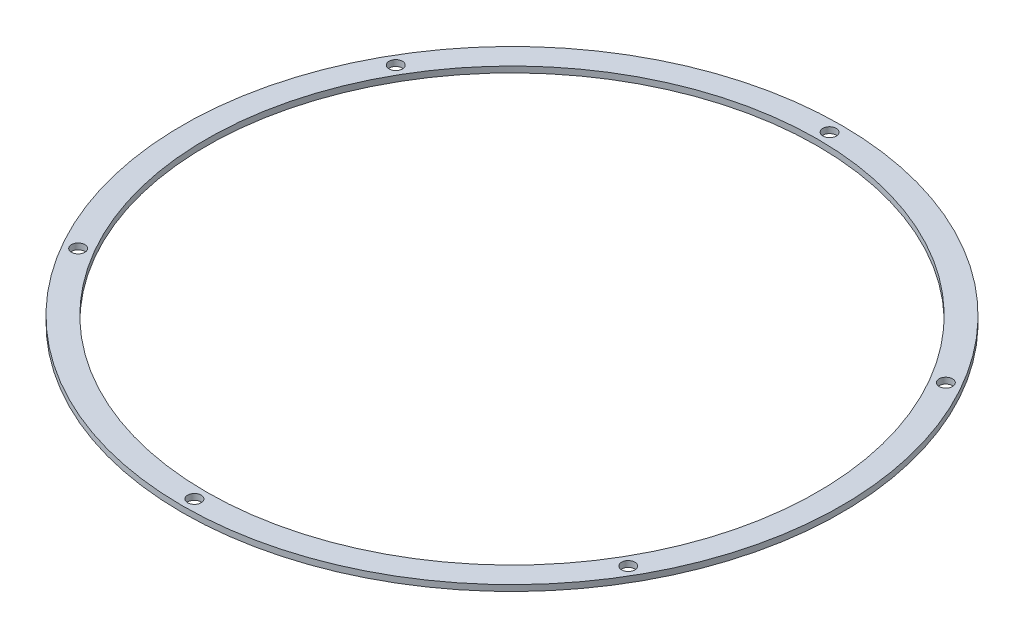
ISO-10303-21;
HEADER;
FILE_DESCRIPTION(('STEP AP214'),'2;1');
FILE_NAME('part.step','',(''),(''),'','','');
FILE_SCHEMA(('AUTOMOTIVE_DESIGN { 1 0 10303 214 1 1 1 1 }'));
ENDSEC;
DATA;
#1=APPLICATION_CONTEXT('core data for automotive mechanical design processes');
#2=APPLICATION_PROTOCOL_DEFINITION('international standard','automotive_design',2000,#1);
#3=PRODUCT_CONTEXT('',#1,'mechanical');
#4=PRODUCT('Part','Part','',(#3));
#5=PRODUCT_RELATED_PRODUCT_CATEGORY('part','',(#4));
#6=PRODUCT_DEFINITION_FORMATION('','',#4);
#7=PRODUCT_DEFINITION_CONTEXT('part definition',#1,'design');
#8=PRODUCT_DEFINITION('design','',#6,#7);
#9=PRODUCT_DEFINITION_SHAPE('','',#8);
#10=(LENGTH_UNIT() NAMED_UNIT(*) SI_UNIT(.MILLI.,.METRE.));
#11=(NAMED_UNIT(*) PLANE_ANGLE_UNIT() SI_UNIT($,.RADIAN.));
#12=(NAMED_UNIT(*) SI_UNIT($,.STERADIAN.) SOLID_ANGLE_UNIT());
#13=UNCERTAINTY_MEASURE_WITH_UNIT(LENGTH_MEASURE(1.E-05),#10,'distance_accuracy_value','');
#14=(GEOMETRIC_REPRESENTATION_CONTEXT(3) GLOBAL_UNCERTAINTY_ASSIGNED_CONTEXT((#13)) GLOBAL_UNIT_ASSIGNED_CONTEXT((#10,
#11,#12)) REPRESENTATION_CONTEXT('',''));
#15=CARTESIAN_POINT('',(0.,0.,0.));
#16=DIRECTION('',(0.,0.,1.));
#17=DIRECTION('',(1.,0.,0.));
#18=AXIS2_PLACEMENT_3D('',#15,#16,#17);
#19=CARTESIAN_POINT('',(0.,3.175,0.));
#20=DIRECTION('',(0.,1.,0.));
#21=DIRECTION('',(0.,0.,1.));
#22=AXIS2_PLACEMENT_3D('',#19,#20,#21);
#23=PLANE('',#22);
#24=CARTESIAN_POINT('',(-145.925280537673,3.175,-84.2499999999916));
#25=DIRECTION('',(0.,1.,0.));
#26=DIRECTION('',(0.,0.,1.));
#27=AXIS2_PLACEMENT_3D('',#24,#25,#26);
#28=CIRCLE('',#27,3.55600000000001);
#29=CARTESIAN_POINT('',(-145.925280537673,3.175,-80.6939999999916));
#30=VERTEX_POINT('',#29);
#31=EDGE_CURVE('E92',#30,#30,#28,.T.);
#32=ORIENTED_EDGE('',*,*,#31,.F.);
#33=EDGE_LOOP('',(#32));
#34=FACE_BOUND('',#33,.T.);
#35=CARTESIAN_POINT('',(1.90943262603954E-11,3.175,168.5));
#36=DIRECTION('',(0.,1.,0.));
#37=DIRECTION('',(0.,0.,1.));
#38=AXIS2_PLACEMENT_3D('',#35,#36,#37);
#39=CIRCLE('',#38,3.55599999999999);
#40=CARTESIAN_POINT('',(1.90943262603954E-11,3.175,172.056));
#41=VERTEX_POINT('',#40);
#42=EDGE_CURVE('E76',#41,#41,#39,.T.);
#43=ORIENTED_EDGE('',*,*,#42,.F.);
#44=EDGE_LOOP('',(#43));
#45=FACE_BOUND('',#44,.T.);
#46=CARTESIAN_POINT('',(145.925280537683,3.175,-84.2500000000083));
#47=DIRECTION('',(0.,1.,0.));
#48=DIRECTION('',(0.,0.,1.));
#49=AXIS2_PLACEMENT_3D('',#46,#47,#48);
#50=CIRCLE('',#49,3.55600000000001);
#51=CARTESIAN_POINT('',(145.925280537683,3.175,-80.6940000000083));
#52=VERTEX_POINT('',#51);
#53=EDGE_CURVE('E60',#52,#52,#50,.T.);
#54=ORIENTED_EDGE('',*,*,#53,.F.);
#55=EDGE_LOOP('',(#54));
#56=FACE_BOUND('',#55,.T.);
#57=CARTESIAN_POINT('',(0.,3.175,0.));
#58=DIRECTION('',(0.,1.,0.));
#59=DIRECTION('',(0.,0.,1.));
#60=AXIS2_PLACEMENT_3D('',#57,#58,#59);
#61=CIRCLE('',#60,174.85);
#62=CARTESIAN_POINT('',(0.,3.175,174.85));
#63=VERTEX_POINT('',#62);
#64=EDGE_CURVE('E10',#63,#63,#61,.T.);
#65=ORIENTED_EDGE('',*,*,#64,.T.);
#66=EDGE_LOOP('',(#65));
#67=FACE_BOUND('',#66,.T.);
#68=CARTESIAN_POINT('',(0.,3.175,-168.5));
#69=DIRECTION('',(0.,1.,0.));
#70=DIRECTION('',(0.,0.,1.));
#71=AXIS2_PLACEMENT_3D('',#68,#69,#70);
#72=CIRCLE('',#71,3.55599999999999);
#73=CARTESIAN_POINT('',(0.,3.175,-164.944));
#74=VERTEX_POINT('',#73);
#75=EDGE_CURVE('E54',#74,#74,#72,.T.);
#76=ORIENTED_EDGE('',*,*,#75,.F.);
#77=EDGE_LOOP('',(#76));
#78=FACE_BOUND('',#77,.T.);
#79=CARTESIAN_POINT('',(145.925280537692,3.175,84.2499999999917));
#80=DIRECTION('',(0.,1.,0.));
#81=DIRECTION('',(0.,0.,1.));
#82=AXIS2_PLACEMENT_3D('',#79,#80,#81);
#83=CIRCLE('',#82,3.55600000000001);
#84=CARTESIAN_POINT('',(145.925280537692,3.175,87.8059999999917));
#85=VERTEX_POINT('',#84);
#86=EDGE_CURVE('E68',#85,#85,#83,.T.);
#87=ORIENTED_EDGE('',*,*,#86,.F.);
#88=EDGE_LOOP('',(#87));
#89=FACE_BOUND('',#88,.T.);
#90=CARTESIAN_POINT('',(-145.925280537664,3.175,84.2500000000083));
#91=DIRECTION('',(0.,1.,0.));
#92=DIRECTION('',(0.,0.,1.));
#93=AXIS2_PLACEMENT_3D('',#90,#91,#92);
#94=CIRCLE('',#93,3.55600000000001);
#95=CARTESIAN_POINT('',(-145.925280537664,3.175,87.8060000000084));
#96=VERTEX_POINT('',#95);
#97=EDGE_CURVE('E84',#96,#96,#94,.T.);
#98=ORIENTED_EDGE('',*,*,#97,.F.);
#99=EDGE_LOOP('',(#98));
#100=FACE_BOUND('',#99,.T.);
#101=CARTESIAN_POINT('',(0.,3.175,0.));
#102=DIRECTION('',(0.,1.,0.));
#103=DIRECTION('',(0.,0.,1.));
#104=AXIS2_PLACEMENT_3D('',#101,#102,#103);
#105=CIRCLE('',#104,162.15);
#106=CARTESIAN_POINT('',(0.,3.175,162.15));
#107=VERTEX_POINT('',#106);
#108=EDGE_CURVE('E100',#107,#107,#105,.T.);
#109=ORIENTED_EDGE('',*,*,#108,.F.);
#110=EDGE_LOOP('',(#109));
#111=FACE_BOUND('',#110,.T.);
#112=ADVANCED_FACE('F41',(#34,#45,#56,#67,#78,#89,#100,#111),#23,.T.);
#113=CARTESIAN_POINT('',(0.,0.,0.));
#114=DIRECTION('',(0.,1.,0.));
#115=DIRECTION('',(0.,0.,1.));
#116=AXIS2_PLACEMENT_3D('',#113,#114,#115);
#117=PLANE('',#116);
#118=CARTESIAN_POINT('',(0.,0.,0.));
#119=DIRECTION('',(0.,1.,0.));
#120=DIRECTION('',(0.,0.,1.));
#121=AXIS2_PLACEMENT_3D('',#118,#119,#120);
#122=CIRCLE('',#121,174.85);
#123=CARTESIAN_POINT('',(0.,0.,174.85));
#124=VERTEX_POINT('',#123);
#125=EDGE_CURVE('E45',#124,#124,#122,.T.);
#126=ORIENTED_EDGE('',*,*,#125,.F.);
#127=EDGE_LOOP('',(#126));
#128=FACE_BOUND('',#127,.T.);
#129=CARTESIAN_POINT('',(0.,0.,-168.5));
#130=DIRECTION('',(0.,1.,0.));
#131=DIRECTION('',(0.,0.,1.));
#132=AXIS2_PLACEMENT_3D('',#129,#130,#131);
#133=CIRCLE('',#132,3.55599999999999);
#134=CARTESIAN_POINT('',(0.,0.,-164.944));
#135=VERTEX_POINT('',#134);
#136=EDGE_CURVE('E56',#135,#135,#133,.T.);
#137=ORIENTED_EDGE('',*,*,#136,.T.);
#138=EDGE_LOOP('',(#137));
#139=FACE_BOUND('',#138,.T.);
#140=CARTESIAN_POINT('',(145.925280537683,0.,-84.2500000000083));
#141=DIRECTION('',(0.,1.,0.));
#142=DIRECTION('',(0.,0.,1.));
#143=AXIS2_PLACEMENT_3D('',#140,#141,#142);
#144=CIRCLE('',#143,3.55600000000001);
#145=CARTESIAN_POINT('',(145.925280537683,0.,-80.6940000000083));
#146=VERTEX_POINT('',#145);
#147=EDGE_CURVE('E64',#146,#146,#144,.T.);
#148=ORIENTED_EDGE('',*,*,#147,.T.);
#149=EDGE_LOOP('',(#148));
#150=FACE_BOUND('',#149,.T.);
#151=CARTESIAN_POINT('',(145.925280537692,0.,84.2499999999917));
#152=DIRECTION('',(0.,1.,0.));
#153=DIRECTION('',(0.,0.,1.));
#154=AXIS2_PLACEMENT_3D('',#151,#152,#153);
#155=CIRCLE('',#154,3.55600000000001);
#156=CARTESIAN_POINT('',(145.925280537692,0.,87.8059999999917));
#157=VERTEX_POINT('',#156);
#158=EDGE_CURVE('E72',#157,#157,#155,.T.);
#159=ORIENTED_EDGE('',*,*,#158,.T.);
#160=EDGE_LOOP('',(#159));
#161=FACE_BOUND('',#160,.T.);
#162=CARTESIAN_POINT('',(1.90943262603954E-11,0.,168.5));
#163=DIRECTION('',(0.,1.,0.));
#164=DIRECTION('',(0.,0.,1.));
#165=AXIS2_PLACEMENT_3D('',#162,#163,#164);
#166=CIRCLE('',#165,3.55599999999999);
#167=CARTESIAN_POINT('',(1.90943262603954E-11,0.,172.056));
#168=VERTEX_POINT('',#167);
#169=EDGE_CURVE('E80',#168,#168,#166,.T.);
#170=ORIENTED_EDGE('',*,*,#169,.T.);
#171=EDGE_LOOP('',(#170));
#172=FACE_BOUND('',#171,.T.);
#173=CARTESIAN_POINT('',(-145.925280537664,0.,84.2500000000083));
#174=DIRECTION('',(0.,1.,0.));
#175=DIRECTION('',(0.,0.,1.));
#176=AXIS2_PLACEMENT_3D('',#173,#174,#175);
#177=CIRCLE('',#176,3.55600000000001);
#178=CARTESIAN_POINT('',(-145.925280537664,0.,87.8060000000084));
#179=VERTEX_POINT('',#178);
#180=EDGE_CURVE('E88',#179,#179,#177,.T.);
#181=ORIENTED_EDGE('',*,*,#180,.T.);
#182=EDGE_LOOP('',(#181));
#183=FACE_BOUND('',#182,.T.);
#184=CARTESIAN_POINT('',(-145.925280537673,0.,-84.2499999999916));
#185=DIRECTION('',(0.,1.,0.));
#186=DIRECTION('',(0.,0.,1.));
#187=AXIS2_PLACEMENT_3D('',#184,#185,#186);
#188=CIRCLE('',#187,3.55600000000001);
#189=CARTESIAN_POINT('',(-145.925280537673,0.,-80.6939999999916));
#190=VERTEX_POINT('',#189);
#191=EDGE_CURVE('E96',#190,#190,#188,.T.);
#192=ORIENTED_EDGE('',*,*,#191,.T.);
#193=EDGE_LOOP('',(#192));
#194=FACE_BOUND('',#193,.T.);
#195=CARTESIAN_POINT('',(0.,0.,0.));
#196=DIRECTION('',(0.,1.,0.));
#197=DIRECTION('',(0.,0.,1.));
#198=AXIS2_PLACEMENT_3D('',#195,#196,#197);
#199=CIRCLE('',#198,162.15);
#200=CARTESIAN_POINT('',(0.,0.,162.15));
#201=VERTEX_POINT('',#200);
#202=EDGE_CURVE('E104',#201,#201,#199,.T.);
#203=ORIENTED_EDGE('',*,*,#202,.T.);
#204=EDGE_LOOP('',(#203));
#205=FACE_BOUND('',#204,.T.);
#206=ADVANCED_FACE('F116',(#128,#139,#150,#161,#172,#183,#194,#205),#117,.F.);
#207=CARTESIAN_POINT('',(0.,3.175,0.));
#208=DIRECTION('',(0.,-1.,0.));
#209=DIRECTION('',(0.,0.,-1.));
#210=AXIS2_PLACEMENT_3D('',#207,#208,#209);
#211=CYLINDRICAL_SURFACE('',#210,174.85);
#212=ORIENTED_EDGE('',*,*,#64,.F.);
#213=EDGE_LOOP('',(#212));
#214=FACE_BOUND('',#213,.T.);
#215=ORIENTED_EDGE('',*,*,#125,.T.);
#216=EDGE_LOOP('',(#215));
#217=FACE_BOUND('',#216,.T.);
#218=ADVANCED_FACE('F43',(#214,#217),#211,.T.);
#219=CARTESIAN_POINT('',(0.,3.175,-168.5));
#220=DIRECTION('',(0.,-1.,0.));
#221=DIRECTION('',(0.,0.,-1.));
#222=AXIS2_PLACEMENT_3D('',#219,#220,#221);
#223=CYLINDRICAL_SURFACE('',#222,3.55599999999999);
#224=ORIENTED_EDGE('',*,*,#75,.T.);
#225=EDGE_LOOP('',(#224));
#226=FACE_BOUND('',#225,.T.);
#227=ORIENTED_EDGE('',*,*,#136,.F.);
#228=EDGE_LOOP('',(#227));
#229=FACE_BOUND('',#228,.T.);
#230=ADVANCED_FACE('F126',(#226,#229),#223,.F.);
#231=CARTESIAN_POINT('',(145.925280537683,3.175,-84.2500000000083));
#232=DIRECTION('',(0.,-1.,0.));
#233=DIRECTION('',(0.,0.,-1.));
#234=AXIS2_PLACEMENT_3D('',#231,#232,#233);
#235=CYLINDRICAL_SURFACE('',#234,3.55600000000001);
#236=ORIENTED_EDGE('',*,*,#53,.T.);
#237=EDGE_LOOP('',(#236));
#238=FACE_BOUND('',#237,.T.);
#239=ORIENTED_EDGE('',*,*,#147,.F.);
#240=EDGE_LOOP('',(#239));
#241=FACE_BOUND('',#240,.T.);
#242=ADVANCED_FACE('F129',(#238,#241),#235,.F.);
#243=CARTESIAN_POINT('',(145.925280537692,3.175,84.2499999999917));
#244=DIRECTION('',(0.,-1.,0.));
#245=DIRECTION('',(0.,0.,-1.));
#246=AXIS2_PLACEMENT_3D('',#243,#244,#245);
#247=CYLINDRICAL_SURFACE('',#246,3.55600000000001);
#248=ORIENTED_EDGE('',*,*,#86,.T.);
#249=EDGE_LOOP('',(#248));
#250=FACE_BOUND('',#249,.T.);
#251=ORIENTED_EDGE('',*,*,#158,.F.);
#252=EDGE_LOOP('',(#251));
#253=FACE_BOUND('',#252,.T.);
#254=ADVANCED_FACE('F133',(#250,#253),#247,.F.);
#255=CARTESIAN_POINT('',(1.90943262603954E-11,3.175,168.5));
#256=DIRECTION('',(0.,-1.,0.));
#257=DIRECTION('',(0.,0.,-1.));
#258=AXIS2_PLACEMENT_3D('',#255,#256,#257);
#259=CYLINDRICAL_SURFACE('',#258,3.55599999999999);
#260=ORIENTED_EDGE('',*,*,#42,.T.);
#261=EDGE_LOOP('',(#260));
#262=FACE_BOUND('',#261,.T.);
#263=ORIENTED_EDGE('',*,*,#169,.F.);
#264=EDGE_LOOP('',(#263));
#265=FACE_BOUND('',#264,.T.);
#266=ADVANCED_FACE('F137',(#262,#265),#259,.F.);
#267=CARTESIAN_POINT('',(-145.925280537664,3.175,84.2500000000083));
#268=DIRECTION('',(0.,-1.,0.));
#269=DIRECTION('',(0.,0.,-1.));
#270=AXIS2_PLACEMENT_3D('',#267,#268,#269);
#271=CYLINDRICAL_SURFACE('',#270,3.55600000000001);
#272=ORIENTED_EDGE('',*,*,#97,.T.);
#273=EDGE_LOOP('',(#272));
#274=FACE_BOUND('',#273,.T.);
#275=ORIENTED_EDGE('',*,*,#180,.F.);
#276=EDGE_LOOP('',(#275));
#277=FACE_BOUND('',#276,.T.);
#278=ADVANCED_FACE('F141',(#274,#277),#271,.F.);
#279=CARTESIAN_POINT('',(-145.925280537673,3.175,-84.2499999999916));
#280=DIRECTION('',(0.,-1.,0.));
#281=DIRECTION('',(0.,0.,-1.));
#282=AXIS2_PLACEMENT_3D('',#279,#280,#281);
#283=CYLINDRICAL_SURFACE('',#282,3.55600000000001);
#284=ORIENTED_EDGE('',*,*,#31,.T.);
#285=EDGE_LOOP('',(#284));
#286=FACE_BOUND('',#285,.T.);
#287=ORIENTED_EDGE('',*,*,#191,.F.);
#288=EDGE_LOOP('',(#287));
#289=FACE_BOUND('',#288,.T.);
#290=ADVANCED_FACE('F145',(#286,#289),#283,.F.);
#291=CARTESIAN_POINT('',(0.,3.175,0.));
#292=DIRECTION('',(0.,-1.,0.));
#293=DIRECTION('',(0.,0.,-1.));
#294=AXIS2_PLACEMENT_3D('',#291,#292,#293);
#295=CYLINDRICAL_SURFACE('',#294,162.15);
#296=ORIENTED_EDGE('',*,*,#108,.T.);
#297=EDGE_LOOP('',(#296));
#298=FACE_BOUND('',#297,.T.);
#299=ORIENTED_EDGE('',*,*,#202,.F.);
#300=EDGE_LOOP('',(#299));
#301=FACE_BOUND('',#300,.T.);
#302=ADVANCED_FACE('F112',(#298,#301),#295,.F.);
#303=CLOSED_SHELL('',(#112,#206,#218,#230,#242,#254,#266,#278,#290,#302));
#304=MANIFOLD_SOLID_BREP('B2',#303);
#305=ADVANCED_BREP_SHAPE_REPRESENTATION('',(#18,#304),#14);
#306=SHAPE_DEFINITION_REPRESENTATION(#9,#305);
ENDSEC;
END-ISO-10303-21;
